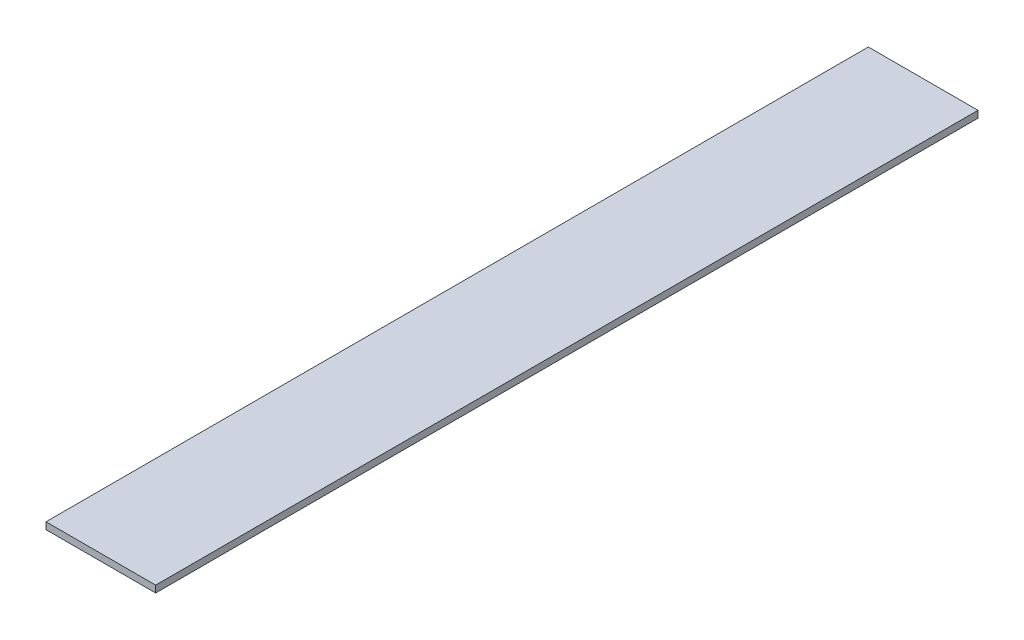
ISO-10303-21;
HEADER;
FILE_DESCRIPTION(('STEP AP214'),'2;1');
FILE_NAME('part.step','',(''),(''),'','','');
FILE_SCHEMA(('AUTOMOTIVE_DESIGN { 1 0 10303 214 1 1 1 1 }'));
ENDSEC;
DATA;
#1=APPLICATION_CONTEXT('core data for automotive mechanical design processes');
#2=APPLICATION_PROTOCOL_DEFINITION('international standard','automotive_design',2000,#1);
#3=PRODUCT_CONTEXT('',#1,'mechanical');
#4=PRODUCT('Part','Part','',(#3));
#5=PRODUCT_RELATED_PRODUCT_CATEGORY('part','',(#4));
#6=PRODUCT_DEFINITION_FORMATION('','',#4);
#7=PRODUCT_DEFINITION_CONTEXT('part definition',#1,'design');
#8=PRODUCT_DEFINITION('design','',#6,#7);
#9=PRODUCT_DEFINITION_SHAPE('','',#8);
#10=(LENGTH_UNIT() NAMED_UNIT(*) SI_UNIT(.MILLI.,.METRE.));
#11=(NAMED_UNIT(*) PLANE_ANGLE_UNIT() SI_UNIT($,.RADIAN.));
#12=(NAMED_UNIT(*) SI_UNIT($,.STERADIAN.) SOLID_ANGLE_UNIT());
#13=UNCERTAINTY_MEASURE_WITH_UNIT(LENGTH_MEASURE(1.E-05),#10,'distance_accuracy_value','');
#14=(GEOMETRIC_REPRESENTATION_CONTEXT(3) GLOBAL_UNCERTAINTY_ASSIGNED_CONTEXT((#13)) GLOBAL_UNIT_ASSIGNED_CONTEXT((#10,
#11,#12)) REPRESENTATION_CONTEXT('',''));
#15=CARTESIAN_POINT('',(0.,0.,0.));
#16=DIRECTION('',(0.,0.,1.));
#17=DIRECTION('',(1.,0.,0.));
#18=AXIS2_PLACEMENT_3D('',#15,#16,#17);
#19=CARTESIAN_POINT('',(522.946000099182,-3.175,190.5));
#20=DIRECTION('',(-1.,0.,0.));
#21=DIRECTION('',(0.,0.,1.));
#22=AXIS2_PLACEMENT_3D('',#19,#20,#21);
#23=PLANE('',#22);
#24=DIRECTION('',(0.,0.,1.));
#25=VECTOR('',#24,1.);
#26=CARTESIAN_POINT('',(522.946000099182,0.,190.5));
#27=LINE('',#26,#25);
#28=CARTESIAN_POINT('',(522.946000099182,0.,0.));
#29=VERTEX_POINT('',#28);
#30=CARTESIAN_POINT('',(522.946000099182,0.,381.));
#31=VERTEX_POINT('',#30);
#32=EDGE_CURVE('E101',#29,#31,#27,.T.);
#33=ORIENTED_EDGE('',*,*,#32,.F.);
#34=DIRECTION('',(0.,1.,0.));
#35=VECTOR('',#34,1.);
#36=CARTESIAN_POINT('',(522.946000099182,-3.175,0.));
#37=LINE('',#36,#35);
#38=CARTESIAN_POINT('',(522.946000099182,-3.175,0.));
#39=VERTEX_POINT('',#38);
#40=EDGE_CURVE('E11',#39,#29,#37,.T.);
#41=ORIENTED_EDGE('',*,*,#40,.F.);
#42=DIRECTION('',(0.,0.,1.));
#43=VECTOR('',#42,1.);
#44=CARTESIAN_POINT('',(522.946000099182,-3.175,190.5));
#45=LINE('',#44,#43);
#46=CARTESIAN_POINT('',(522.946000099182,-3.175,381.));
#47=VERTEX_POINT('',#46);
#48=EDGE_CURVE('E79',#39,#47,#45,.T.);
#49=ORIENTED_EDGE('',*,*,#48,.T.);
#50=DIRECTION('',(0.,1.,0.));
#51=VECTOR('',#50,1.);
#52=CARTESIAN_POINT('',(522.946000099182,-3.175,381.));
#53=LINE('',#52,#51);
#54=EDGE_CURVE('E38',#47,#31,#53,.T.);
#55=ORIENTED_EDGE('',*,*,#54,.T.);
#56=EDGE_LOOP('',(#33,#41,#49,#55));
#57=FACE_BOUND('',#56,.T.);
#58=ADVANCED_FACE('F16',(#57),#23,.T.);
#59=CARTESIAN_POINT('',(548.346000099182,-3.175,0.));
#60=DIRECTION('',(0.,0.,1.));
#61=DIRECTION('',(1.,0.,0.));
#62=AXIS2_PLACEMENT_3D('',#59,#60,#61);
#63=PLANE('',#62);
#64=DIRECTION('',(1.,0.,0.));
#65=VECTOR('',#64,1.);
#66=CARTESIAN_POINT('',(548.346000099182,0.,0.));
#67=LINE('',#66,#65);
#68=CARTESIAN_POINT('',(573.746000099182,0.,0.));
#69=VERTEX_POINT('',#68);
#70=EDGE_CURVE('E86',#29,#69,#67,.T.);
#71=ORIENTED_EDGE('',*,*,#70,.T.);
#72=DIRECTION('',(0.,1.,0.));
#73=VECTOR('',#72,1.);
#74=CARTESIAN_POINT('',(573.746000099182,-3.175,0.));
#75=LINE('',#74,#73);
#76=CARTESIAN_POINT('',(573.746000099182,-3.175,0.));
#77=VERTEX_POINT('',#76);
#78=EDGE_CURVE('E25',#77,#69,#75,.T.);
#79=ORIENTED_EDGE('',*,*,#78,.F.);
#80=DIRECTION('',(1.,0.,0.));
#81=VECTOR('',#80,1.);
#82=CARTESIAN_POINT('',(548.346000099182,-3.175,0.));
#83=LINE('',#82,#81);
#84=EDGE_CURVE('E73',#39,#77,#83,.T.);
#85=ORIENTED_EDGE('',*,*,#84,.F.);
#86=ORIENTED_EDGE('',*,*,#40,.T.);
#87=EDGE_LOOP('',(#71,#79,#85,#86));
#88=FACE_BOUND('',#87,.T.);
#89=ADVANCED_FACE('F84',(#88),#63,.F.);
#90=CARTESIAN_POINT('',(573.746000099182,-3.175,190.5));
#91=DIRECTION('',(-1.,0.,0.));
#92=DIRECTION('',(0.,0.,1.));
#93=AXIS2_PLACEMENT_3D('',#90,#91,#92);
#94=PLANE('',#93);
#95=DIRECTION('',(0.,0.,1.));
#96=VECTOR('',#95,1.);
#97=CARTESIAN_POINT('',(573.746000099182,0.,190.5));
#98=LINE('',#97,#96);
#99=CARTESIAN_POINT('',(573.746000099182,0.,381.));
#100=VERTEX_POINT('',#99);
#101=EDGE_CURVE('E106',#69,#100,#98,.T.);
#102=ORIENTED_EDGE('',*,*,#101,.T.);
#103=DIRECTION('',(0.,1.,0.));
#104=VECTOR('',#103,1.);
#105=CARTESIAN_POINT('',(573.746000099182,-3.175,381.));
#106=LINE('',#105,#104);
#107=CARTESIAN_POINT('',(573.746000099182,-3.175,381.));
#108=VERTEX_POINT('',#107);
#109=EDGE_CURVE('E56',#108,#100,#106,.T.);
#110=ORIENTED_EDGE('',*,*,#109,.F.);
#111=DIRECTION('',(0.,0.,1.));
#112=VECTOR('',#111,1.);
#113=CARTESIAN_POINT('',(573.746000099182,-3.175,190.5));
#114=LINE('',#113,#112);
#115=EDGE_CURVE('E78',#77,#108,#114,.T.);
#116=ORIENTED_EDGE('',*,*,#115,.F.);
#117=ORIENTED_EDGE('',*,*,#78,.T.);
#118=EDGE_LOOP('',(#102,#110,#116,#117));
#119=FACE_BOUND('',#118,.T.);
#120=ADVANCED_FACE('F90',(#119),#94,.F.);
#121=CARTESIAN_POINT('',(548.346000099182,-3.175,381.));
#122=DIRECTION('',(0.,0.,1.));
#123=DIRECTION('',(1.,0.,0.));
#124=AXIS2_PLACEMENT_3D('',#121,#122,#123);
#125=PLANE('',#124);
#126=DIRECTION('',(1.,0.,0.));
#127=VECTOR('',#126,1.);
#128=CARTESIAN_POINT('',(548.346000099182,0.,381.));
#129=LINE('',#128,#127);
#130=EDGE_CURVE('E108',#31,#100,#129,.T.);
#131=ORIENTED_EDGE('',*,*,#130,.F.);
#132=ORIENTED_EDGE('',*,*,#54,.F.);
#133=DIRECTION('',(1.,0.,0.));
#134=VECTOR('',#133,1.);
#135=CARTESIAN_POINT('',(548.346000099182,-3.175,381.));
#136=LINE('',#135,#134);
#137=EDGE_CURVE('E92',#47,#108,#136,.T.);
#138=ORIENTED_EDGE('',*,*,#137,.T.);
#139=ORIENTED_EDGE('',*,*,#109,.T.);
#140=EDGE_LOOP('',(#131,#132,#138,#139));
#141=FACE_BOUND('',#140,.T.);
#142=ADVANCED_FACE('F127',(#141),#125,.T.);
#143=CARTESIAN_POINT('',(548.346000099182,-3.175,190.5));
#144=DIRECTION('',(0.,-1.,0.));
#145=DIRECTION('',(1.,0.,0.));
#146=AXIS2_PLACEMENT_3D('',#143,#144,#145);
#147=PLANE('',#146);
#148=ORIENTED_EDGE('',*,*,#48,.F.);
#149=ORIENTED_EDGE('',*,*,#84,.T.);
#150=ORIENTED_EDGE('',*,*,#115,.T.);
#151=ORIENTED_EDGE('',*,*,#137,.F.);
#152=EDGE_LOOP('',(#148,#149,#150,#151));
#153=FACE_BOUND('',#152,.T.);
#154=ADVANCED_FACE('F75',(#153),#147,.T.);
#155=CARTESIAN_POINT('',(548.346000099182,0.,190.5));
#156=DIRECTION('',(0.,-1.,0.));
#157=DIRECTION('',(1.,0.,0.));
#158=AXIS2_PLACEMENT_3D('',#155,#156,#157);
#159=PLANE('',#158);
#160=ORIENTED_EDGE('',*,*,#32,.T.);
#161=ORIENTED_EDGE('',*,*,#130,.T.);
#162=ORIENTED_EDGE('',*,*,#101,.F.);
#163=ORIENTED_EDGE('',*,*,#70,.F.);
#164=EDGE_LOOP('',(#160,#161,#162,#163));
#165=FACE_BOUND('',#164,.T.);
#166=ADVANCED_FACE('F135',(#165),#159,.F.);
#167=CLOSED_SHELL('',(#58,#89,#120,#142,#154,#166));
#168=MANIFOLD_SOLID_BREP('B1',#167);
#169=ADVANCED_BREP_SHAPE_REPRESENTATION('',(#18,#168),#14);
#170=SHAPE_DEFINITION_REPRESENTATION(#9,#169);
ENDSEC;
END-ISO-10303-21;
